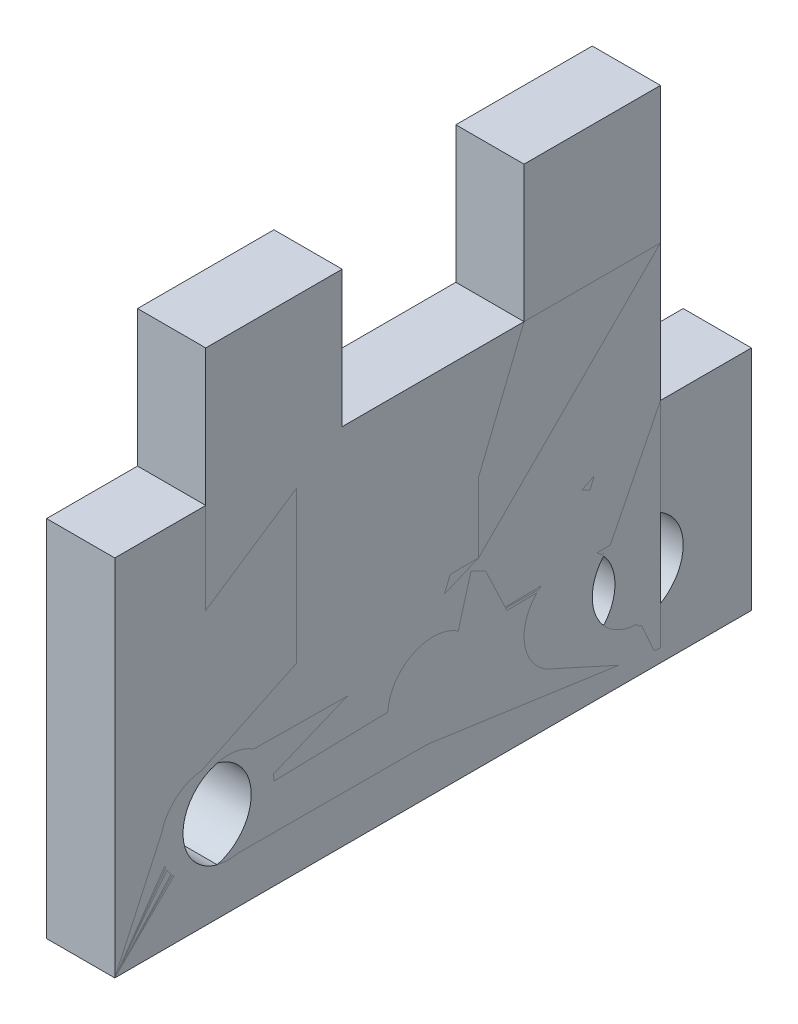
ISO-10303-21;
HEADER;
FILE_DESCRIPTION(('STEP AP214'),'2;1');
FILE_NAME('part.step','',(''),(''),'','','');
FILE_SCHEMA(('AUTOMOTIVE_DESIGN { 1 0 10303 214 1 1 1 1 }'));
ENDSEC;
DATA;
#1=APPLICATION_CONTEXT('core data for automotive mechanical design processes');
#2=APPLICATION_PROTOCOL_DEFINITION('international standard','automotive_design',2000,#1);
#3=PRODUCT_CONTEXT('',#1,'mechanical');
#4=PRODUCT('Part','Part','',(#3));
#5=PRODUCT_RELATED_PRODUCT_CATEGORY('part','',(#4));
#6=PRODUCT_DEFINITION_FORMATION('','',#4);
#7=PRODUCT_DEFINITION_CONTEXT('part definition',#1,'design');
#8=PRODUCT_DEFINITION('design','',#6,#7);
#9=PRODUCT_DEFINITION_SHAPE('','',#8);
#10=(LENGTH_UNIT() NAMED_UNIT(*) SI_UNIT(.MILLI.,.METRE.));
#11=(NAMED_UNIT(*) PLANE_ANGLE_UNIT() SI_UNIT($,.RADIAN.));
#12=(NAMED_UNIT(*) SI_UNIT($,.STERADIAN.) SOLID_ANGLE_UNIT());
#13=UNCERTAINTY_MEASURE_WITH_UNIT(LENGTH_MEASURE(1.E-05),#10,'distance_accuracy_value','');
#14=(GEOMETRIC_REPRESENTATION_CONTEXT(3) GLOBAL_UNCERTAINTY_ASSIGNED_CONTEXT((#13)) GLOBAL_UNIT_ASSIGNED_CONTEXT((#10,
#11,#12)) REPRESENTATION_CONTEXT('',''));
#15=CARTESIAN_POINT('',(0.,0.,0.));
#16=DIRECTION('',(0.,0.,1.));
#17=DIRECTION('',(1.,0.,0.));
#18=AXIS2_PLACEMENT_3D('',#15,#16,#17);
#19=CARTESIAN_POINT('',(15.,0.,0.));
#20=DIRECTION('',(-1.,0.,0.));
#21=DIRECTION('',(0.,0.,1.));
#22=AXIS2_PLACEMENT_3D('',#19,#20,#21);
#23=PLANE('',#22);
#24=DIRECTION('',(0.,-1.,0.));
#25=VECTOR('',#24,1.);
#26=CARTESIAN_POINT('',(15.,0.,0.));
#27=LINE('',#26,#25);
#28=CARTESIAN_POINT('',(15.,60.,0.));
#29=VERTEX_POINT('',#28);
#30=CARTESIAN_POINT('',(15.,0.,0.));
#31=VERTEX_POINT('',#30);
#32=EDGE_CURVE('E212',#29,#31,#27,.T.);
#33=ORIENTED_EDGE('',*,*,#32,.T.);
#34=DIRECTION('',(0.,0.,-1.));
#35=VECTOR('',#34,1.);
#36=CARTESIAN_POINT('',(15.,0.,0.));
#37=LINE('',#36,#35);
#38=CARTESIAN_POINT('',(15.,0.,-140.));
#39=VERTEX_POINT('',#38);
#40=EDGE_CURVE('E124',#31,#39,#37,.T.);
#41=ORIENTED_EDGE('',*,*,#40,.T.);
#42=DIRECTION('',(0.,1.,0.));
#43=VECTOR('',#42,1.);
#44=CARTESIAN_POINT('',(15.,50.,-140.));
#45=LINE('',#44,#43);
#46=CARTESIAN_POINT('',(15.,50.,-140.));
#47=VERTEX_POINT('',#46);
#48=EDGE_CURVE('E249',#39,#47,#45,.T.);
#49=ORIENTED_EDGE('',*,*,#48,.T.);
#50=DIRECTION('',(0.,0.,1.));
#51=VECTOR('',#50,1.);
#52=CARTESIAN_POINT('',(15.,50.,-120.));
#53=LINE('',#52,#51);
#54=CARTESIAN_POINT('',(15.,50.,-120.));
#55=VERTEX_POINT('',#54);
#56=EDGE_CURVE('E269',#47,#55,#53,.T.);
#57=ORIENTED_EDGE('',*,*,#56,.T.);
#58=DIRECTION('',(0.,1.,0.));
#59=VECTOR('',#58,1.);
#60=CARTESIAN_POINT('',(15.,110.,-120.));
#61=LINE('',#60,#59);
#62=CARTESIAN_POINT('',(15.,110.,-120.));
#63=VERTEX_POINT('',#62);
#64=EDGE_CURVE('E265',#55,#63,#61,.T.);
#65=ORIENTED_EDGE('',*,*,#64,.T.);
#66=DIRECTION('',(0.,0.,1.));
#67=VECTOR('',#66,1.);
#68=CARTESIAN_POINT('',(15.,110.,-90.));
#69=LINE('',#68,#67);
#70=CARTESIAN_POINT('',(15.,110.,-90.));
#71=VERTEX_POINT('',#70);
#72=EDGE_CURVE('E268',#63,#71,#69,.T.);
#73=ORIENTED_EDGE('',*,*,#72,.T.);
#74=DIRECTION('',(0.,-1.,0.));
#75=VECTOR('',#74,1.);
#76=CARTESIAN_POINT('',(15.,80.,-90.));
#77=LINE('',#76,#75);
#78=CARTESIAN_POINT('',(15.,80.,-90.));
#79=VERTEX_POINT('',#78);
#80=EDGE_CURVE('E273',#71,#79,#77,.T.);
#81=ORIENTED_EDGE('',*,*,#80,.T.);
#82=DIRECTION('',(0.,0.,1.));
#83=VECTOR('',#82,1.);
#84=CARTESIAN_POINT('',(15.,80.,-50.));
#85=LINE('',#84,#83);
#86=CARTESIAN_POINT('',(15.,80.,-50.));
#87=VERTEX_POINT('',#86);
#88=EDGE_CURVE('E280',#79,#87,#85,.T.);
#89=ORIENTED_EDGE('',*,*,#88,.T.);
#90=DIRECTION('',(0.,1.,0.));
#91=VECTOR('',#90,1.);
#92=CARTESIAN_POINT('',(15.,110.,-50.));
#93=LINE('',#92,#91);
#94=CARTESIAN_POINT('',(15.,110.,-50.));
#95=VERTEX_POINT('',#94);
#96=EDGE_CURVE('E155',#87,#95,#93,.T.);
#97=ORIENTED_EDGE('',*,*,#96,.T.);
#98=DIRECTION('',(0.,0.,1.));
#99=VECTOR('',#98,1.);
#100=CARTESIAN_POINT('',(15.,110.,-20.));
#101=LINE('',#100,#99);
#102=CARTESIAN_POINT('',(15.,110.,-20.));
#103=VERTEX_POINT('',#102);
#104=EDGE_CURVE('E149',#95,#103,#101,.T.);
#105=ORIENTED_EDGE('',*,*,#104,.T.);
#106=DIRECTION('',(0.,-1.,0.));
#107=VECTOR('',#106,1.);
#108=CARTESIAN_POINT('',(15.,60.,-20.));
#109=LINE('',#108,#107);
#110=CARTESIAN_POINT('',(15.,60.,-20.));
#111=VERTEX_POINT('',#110);
#112=EDGE_CURVE('E153',#103,#111,#109,.T.);
#113=ORIENTED_EDGE('',*,*,#112,.T.);
#114=DIRECTION('',(0.,0.,1.));
#115=VECTOR('',#114,1.);
#116=CARTESIAN_POINT('',(15.,60.,0.));
#117=LINE('',#116,#115);
#118=EDGE_CURVE('E69',#111,#29,#117,.T.);
#119=ORIENTED_EDGE('',*,*,#118,.T.);
#120=EDGE_LOOP('',(#33,#41,#49,#57,#65,#73,#81,#89,#97,#105,#113,#119));
#121=FACE_BOUND('',#120,.T.);
#122=CARTESIAN_POINT('',(15.,20.,-70.));
#123=DIRECTION('',(1.,0.,0.));
#124=DIRECTION('',(0.,0.,-1.));
#125=AXIS2_PLACEMENT_3D('',#122,#123,#124);
#126=CIRCLE('',#125,9.99999999999999);
#127=CARTESIAN_POINT('',(15.,20.,-80.));
#128=VERTEX_POINT('',#127);
#129=EDGE_CURVE('E182',#128,#128,#126,.T.);
#130=ORIENTED_EDGE('',*,*,#129,.F.);
#131=EDGE_LOOP('',(#130));
#132=FACE_BOUND('',#131,.T.);
#133=CARTESIAN_POINT('',(15.,20.,-115.));
#134=DIRECTION('',(1.,0.,0.));
#135=DIRECTION('',(0.,0.,-1.));
#136=AXIS2_PLACEMENT_3D('',#133,#134,#135);
#137=CIRCLE('',#136,9.99999999999999);
#138=CARTESIAN_POINT('',(15.,20.,-125.));
#139=VERTEX_POINT('',#138);
#140=EDGE_CURVE('E338',#139,#139,#137,.T.);
#141=ORIENTED_EDGE('',*,*,#140,.F.);
#142=EDGE_LOOP('',(#141));
#143=FACE_BOUND('',#142,.T.);
#144=CARTESIAN_POINT('',(15.,20.,-25.));
#145=DIRECTION('',(1.,0.,0.));
#146=DIRECTION('',(0.,0.,-1.));
#147=AXIS2_PLACEMENT_3D('',#144,#145,#146);
#148=CIRCLE('',#147,10.);
#149=CARTESIAN_POINT('',(15.,20.,-35.));
#150=VERTEX_POINT('',#149);
#151=EDGE_CURVE('E327',#150,#150,#148,.T.);
#152=ORIENTED_EDGE('',*,*,#151,.F.);
#153=EDGE_LOOP('',(#152));
#154=FACE_BOUND('',#153,.T.);
#155=ADVANCED_FACE('F51',(#121,#132,#143,#154),#23,.F.);
#156=CARTESIAN_POINT('',(0.,0.,0.));
#157=DIRECTION('',(-1.,0.,0.));
#158=DIRECTION('',(0.,0.,1.));
#159=AXIS2_PLACEMENT_3D('',#156,#157,#158);
#160=PLANE('',#159);
#161=CARTESIAN_POINT('',(0.,20.,-115.));
#162=DIRECTION('',(1.,0.,0.));
#163=DIRECTION('',(0.,0.,-1.));
#164=AXIS2_PLACEMENT_3D('',#161,#162,#163);
#165=CIRCLE('',#164,9.99999999999999);
#166=CARTESIAN_POINT('',(0.,20.,-125.));
#167=VERTEX_POINT('',#166);
#168=EDGE_CURVE('E335',#167,#167,#165,.T.);
#169=ORIENTED_EDGE('',*,*,#168,.T.);
#170=EDGE_LOOP('',(#169));
#171=FACE_BOUND('',#170,.T.);
#172=DIRECTION('',(0.,-1.,0.));
#173=VECTOR('',#172,1.);
#174=CARTESIAN_POINT('',(0.,0.,0.));
#175=LINE('',#174,#173);
#176=CARTESIAN_POINT('',(0.,60.,0.));
#177=VERTEX_POINT('',#176);
#178=CARTESIAN_POINT('',(0.,0.,0.));
#179=VERTEX_POINT('',#178);
#180=EDGE_CURVE('E177',#177,#179,#175,.T.);
#181=ORIENTED_EDGE('',*,*,#180,.F.);
#182=DIRECTION('',(0.,0.,1.));
#183=VECTOR('',#182,1.);
#184=CARTESIAN_POINT('',(0.,60.,0.));
#185=LINE('',#184,#183);
#186=CARTESIAN_POINT('',(0.,60.,-20.));
#187=VERTEX_POINT('',#186);
#188=EDGE_CURVE('E116',#187,#177,#185,.T.);
#189=ORIENTED_EDGE('',*,*,#188,.F.);
#190=DIRECTION('',(0.,-1.,0.));
#191=VECTOR('',#190,1.);
#192=CARTESIAN_POINT('',(0.,60.,-20.));
#193=LINE('',#192,#191);
#194=CARTESIAN_POINT('',(0.,110.,-20.));
#195=VERTEX_POINT('',#194);
#196=EDGE_CURVE('E110',#195,#187,#193,.T.);
#197=ORIENTED_EDGE('',*,*,#196,.F.);
#198=DIRECTION('',(0.,0.,1.));
#199=VECTOR('',#198,1.);
#200=CARTESIAN_POINT('',(0.,110.,-20.));
#201=LINE('',#200,#199);
#202=CARTESIAN_POINT('',(0.,110.,-50.));
#203=VERTEX_POINT('',#202);
#204=EDGE_CURVE('E164',#203,#195,#201,.T.);
#205=ORIENTED_EDGE('',*,*,#204,.F.);
#206=DIRECTION('',(0.,1.,0.));
#207=VECTOR('',#206,1.);
#208=CARTESIAN_POINT('',(0.,110.,-50.));
#209=LINE('',#208,#207);
#210=CARTESIAN_POINT('',(0.,80.,-50.));
#211=VERTEX_POINT('',#210);
#212=EDGE_CURVE('E203',#211,#203,#209,.T.);
#213=ORIENTED_EDGE('',*,*,#212,.F.);
#214=DIRECTION('',(0.,0.,1.));
#215=VECTOR('',#214,1.);
#216=CARTESIAN_POINT('',(0.,80.,-50.));
#217=LINE('',#216,#215);
#218=CARTESIAN_POINT('',(0.,80.,-90.));
#219=VERTEX_POINT('',#218);
#220=EDGE_CURVE('E200',#219,#211,#217,.T.);
#221=ORIENTED_EDGE('',*,*,#220,.F.);
#222=DIRECTION('',(0.,-1.,0.));
#223=VECTOR('',#222,1.);
#224=CARTESIAN_POINT('',(0.,80.,-90.));
#225=LINE('',#224,#223);
#226=CARTESIAN_POINT('',(0.,110.,-90.));
#227=VERTEX_POINT('',#226);
#228=EDGE_CURVE('E197',#227,#219,#225,.T.);
#229=ORIENTED_EDGE('',*,*,#228,.F.);
#230=DIRECTION('',(0.,0.,1.));
#231=VECTOR('',#230,1.);
#232=CARTESIAN_POINT('',(0.,110.,-90.));
#233=LINE('',#232,#231);
#234=CARTESIAN_POINT('',(0.,110.,-120.));
#235=VERTEX_POINT('',#234);
#236=EDGE_CURVE('E194',#235,#227,#233,.T.);
#237=ORIENTED_EDGE('',*,*,#236,.F.);
#238=DIRECTION('',(0.,1.,0.));
#239=VECTOR('',#238,1.);
#240=CARTESIAN_POINT('',(0.,110.,-120.));
#241=LINE('',#240,#239);
#242=CARTESIAN_POINT('',(0.,50.,-120.));
#243=VERTEX_POINT('',#242);
#244=EDGE_CURVE('E191',#243,#235,#241,.T.);
#245=ORIENTED_EDGE('',*,*,#244,.F.);
#246=DIRECTION('',(0.,0.,1.));
#247=VECTOR('',#246,1.);
#248=CARTESIAN_POINT('',(0.,50.,-120.));
#249=LINE('',#248,#247);
#250=CARTESIAN_POINT('',(0.,50.,-140.));
#251=VERTEX_POINT('',#250);
#252=EDGE_CURVE('E188',#251,#243,#249,.T.);
#253=ORIENTED_EDGE('',*,*,#252,.F.);
#254=DIRECTION('',(0.,1.,0.));
#255=VECTOR('',#254,1.);
#256=CARTESIAN_POINT('',(0.,50.,-140.));
#257=LINE('',#256,#255);
#258=CARTESIAN_POINT('',(0.,0.,-140.));
#259=VERTEX_POINT('',#258);
#260=EDGE_CURVE('E185',#259,#251,#257,.T.);
#261=ORIENTED_EDGE('',*,*,#260,.F.);
#262=DIRECTION('',(0.,0.,-1.));
#263=VECTOR('',#262,1.);
#264=CARTESIAN_POINT('',(0.,0.,0.));
#265=LINE('',#264,#263);
#266=EDGE_CURVE('E181',#179,#259,#265,.T.);
#267=ORIENTED_EDGE('',*,*,#266,.F.);
#268=EDGE_LOOP('',(#181,#189,#197,#205,#213,#221,#229,#237,#245,#253,#261,#267));
#269=FACE_BOUND('',#268,.T.);
#270=CARTESIAN_POINT('',(0.,20.,-70.));
#271=DIRECTION('',(1.,0.,0.));
#272=DIRECTION('',(0.,0.,-1.));
#273=AXIS2_PLACEMENT_3D('',#270,#271,#272);
#274=CIRCLE('',#273,9.99999999999999);
#275=CARTESIAN_POINT('',(0.,20.,-80.));
#276=VERTEX_POINT('',#275);
#277=EDGE_CURVE('E342',#276,#276,#274,.T.);
#278=ORIENTED_EDGE('',*,*,#277,.T.);
#279=EDGE_LOOP('',(#278));
#280=FACE_BOUND('',#279,.T.);
#281=CARTESIAN_POINT('',(0.,20.,-25.));
#282=DIRECTION('',(1.,0.,0.));
#283=DIRECTION('',(0.,0.,-1.));
#284=AXIS2_PLACEMENT_3D('',#281,#282,#283);
#285=CIRCLE('',#284,10.);
#286=CARTESIAN_POINT('',(0.,20.,-35.));
#287=VERTEX_POINT('',#286);
#288=EDGE_CURVE('E330',#287,#287,#285,.T.);
#289=ORIENTED_EDGE('',*,*,#288,.T.);
#290=EDGE_LOOP('',(#289));
#291=FACE_BOUND('',#290,.T.);
#292=ADVANCED_FACE('F253',(#171,#269,#280,#291),#160,.T.);
#293=CARTESIAN_POINT('',(15.,0.,0.));
#294=DIRECTION('',(0.,0.,-1.));
#295=DIRECTION('',(-1.,0.,0.));
#296=AXIS2_PLACEMENT_3D('',#293,#294,#295);
#297=PLANE('',#296);
#298=ORIENTED_EDGE('',*,*,#180,.T.);
#299=DIRECTION('',(-1.,0.,0.));
#300=VECTOR('',#299,1.);
#301=CARTESIAN_POINT('',(15.,0.,0.));
#302=LINE('',#301,#300);
#303=EDGE_CURVE('E12',#31,#179,#302,.T.);
#304=ORIENTED_EDGE('',*,*,#303,.F.);
#305=ORIENTED_EDGE('',*,*,#32,.F.);
#306=DIRECTION('',(-1.,0.,0.));
#307=VECTOR('',#306,1.);
#308=CARTESIAN_POINT('',(15.,60.,0.));
#309=LINE('',#308,#307);
#310=EDGE_CURVE('E173',#29,#177,#309,.T.);
#311=ORIENTED_EDGE('',*,*,#310,.T.);
#312=EDGE_LOOP('',(#298,#304,#305,#311));
#313=FACE_BOUND('',#312,.T.);
#314=ADVANCED_FACE('F53',(#313),#297,.F.);
#315=CARTESIAN_POINT('',(15.,0.,0.));
#316=DIRECTION('',(0.,1.,0.));
#317=DIRECTION('',(0.,0.,1.));
#318=AXIS2_PLACEMENT_3D('',#315,#316,#317);
#319=PLANE('',#318);
#320=ORIENTED_EDGE('',*,*,#266,.T.);
#321=DIRECTION('',(-1.,0.,0.));
#322=VECTOR('',#321,1.);
#323=CARTESIAN_POINT('',(15.,0.,-140.));
#324=LINE('',#323,#322);
#325=EDGE_CURVE('E61',#39,#259,#324,.T.);
#326=ORIENTED_EDGE('',*,*,#325,.F.);
#327=ORIENTED_EDGE('',*,*,#40,.F.);
#328=ORIENTED_EDGE('',*,*,#303,.T.);
#329=EDGE_LOOP('',(#320,#326,#327,#328));
#330=FACE_BOUND('',#329,.T.);
#331=ADVANCED_FACE('F451',(#330),#319,.F.);
#332=CARTESIAN_POINT('',(15.,50.,-140.));
#333=DIRECTION('',(0.,0.,1.));
#334=DIRECTION('',(1.,0.,0.));
#335=AXIS2_PLACEMENT_3D('',#332,#333,#334);
#336=PLANE('',#335);
#337=ORIENTED_EDGE('',*,*,#260,.T.);
#338=DIRECTION('',(-1.,0.,0.));
#339=VECTOR('',#338,1.);
#340=CARTESIAN_POINT('',(15.,50.,-140.));
#341=LINE('',#340,#339);
#342=EDGE_CURVE('E239',#47,#251,#341,.T.);
#343=ORIENTED_EDGE('',*,*,#342,.F.);
#344=ORIENTED_EDGE('',*,*,#48,.F.);
#345=ORIENTED_EDGE('',*,*,#325,.T.);
#346=EDGE_LOOP('',(#337,#343,#344,#345));
#347=FACE_BOUND('',#346,.T.);
#348=ADVANCED_FACE('F247',(#347),#336,.F.);
#349=CARTESIAN_POINT('',(15.,50.,-120.));
#350=DIRECTION('',(0.,-1.,0.));
#351=DIRECTION('',(0.,0.,-1.));
#352=AXIS2_PLACEMENT_3D('',#349,#350,#351);
#353=PLANE('',#352);
#354=ORIENTED_EDGE('',*,*,#252,.T.);
#355=DIRECTION('',(-1.,0.,0.));
#356=VECTOR('',#355,1.);
#357=CARTESIAN_POINT('',(15.,50.,-120.));
#358=LINE('',#357,#356);
#359=EDGE_CURVE('E235',#55,#243,#358,.T.);
#360=ORIENTED_EDGE('',*,*,#359,.F.);
#361=ORIENTED_EDGE('',*,*,#56,.F.);
#362=ORIENTED_EDGE('',*,*,#342,.T.);
#363=EDGE_LOOP('',(#354,#360,#361,#362));
#364=FACE_BOUND('',#363,.T.);
#365=ADVANCED_FACE('F259',(#364),#353,.F.);
#366=CARTESIAN_POINT('',(15.,110.,-120.));
#367=DIRECTION('',(0.,0.,1.));
#368=DIRECTION('',(0.,-1.,0.));
#369=AXIS2_PLACEMENT_3D('',#366,#367,#368);
#370=PLANE('',#369);
#371=ORIENTED_EDGE('',*,*,#244,.T.);
#372=DIRECTION('',(-1.,0.,0.));
#373=VECTOR('',#372,1.);
#374=CARTESIAN_POINT('',(15.,110.,-120.));
#375=LINE('',#374,#373);
#376=EDGE_CURVE('E231',#63,#235,#375,.T.);
#377=ORIENTED_EDGE('',*,*,#376,.F.);
#378=ORIENTED_EDGE('',*,*,#64,.F.);
#379=ORIENTED_EDGE('',*,*,#359,.T.);
#380=EDGE_LOOP('',(#371,#377,#378,#379));
#381=FACE_BOUND('',#380,.T.);
#382=ADVANCED_FACE('F263',(#381),#370,.F.);
#383=CARTESIAN_POINT('',(15.,110.,-90.));
#384=DIRECTION('',(0.,-1.,0.));
#385=DIRECTION('',(0.,0.,-1.));
#386=AXIS2_PLACEMENT_3D('',#383,#384,#385);
#387=PLANE('',#386);
#388=ORIENTED_EDGE('',*,*,#236,.T.);
#389=DIRECTION('',(-1.,0.,0.));
#390=VECTOR('',#389,1.);
#391=CARTESIAN_POINT('',(15.,110.,-90.));
#392=LINE('',#391,#390);
#393=EDGE_CURVE('E227',#71,#227,#392,.T.);
#394=ORIENTED_EDGE('',*,*,#393,.F.);
#395=ORIENTED_EDGE('',*,*,#72,.F.);
#396=ORIENTED_EDGE('',*,*,#376,.T.);
#397=EDGE_LOOP('',(#388,#394,#395,#396));
#398=FACE_BOUND('',#397,.T.);
#399=ADVANCED_FACE('F416',(#398),#387,.F.);
#400=CARTESIAN_POINT('',(15.,80.,-90.));
#401=DIRECTION('',(0.,0.,-1.));
#402=DIRECTION('',(-1.,0.,0.));
#403=AXIS2_PLACEMENT_3D('',#400,#401,#402);
#404=PLANE('',#403);
#405=ORIENTED_EDGE('',*,*,#228,.T.);
#406=DIRECTION('',(-1.,0.,0.));
#407=VECTOR('',#406,1.);
#408=CARTESIAN_POINT('',(15.,80.,-90.));
#409=LINE('',#408,#407);
#410=EDGE_CURVE('E223',#79,#219,#409,.T.);
#411=ORIENTED_EDGE('',*,*,#410,.F.);
#412=ORIENTED_EDGE('',*,*,#80,.F.);
#413=ORIENTED_EDGE('',*,*,#393,.T.);
#414=EDGE_LOOP('',(#405,#411,#412,#413));
#415=FACE_BOUND('',#414,.T.);
#416=ADVANCED_FACE('F407',(#415),#404,.F.);
#417=CARTESIAN_POINT('',(15.,80.,-50.));
#418=DIRECTION('',(0.,-1.,0.));
#419=DIRECTION('',(0.,0.,-1.));
#420=AXIS2_PLACEMENT_3D('',#417,#418,#419);
#421=PLANE('',#420);
#422=ORIENTED_EDGE('',*,*,#220,.T.);
#423=DIRECTION('',(-1.,0.,0.));
#424=VECTOR('',#423,1.);
#425=CARTESIAN_POINT('',(15.,80.,-50.));
#426=LINE('',#425,#424);
#427=EDGE_CURVE('E219',#87,#211,#426,.T.);
#428=ORIENTED_EDGE('',*,*,#427,.F.);
#429=ORIENTED_EDGE('',*,*,#88,.F.);
#430=ORIENTED_EDGE('',*,*,#410,.T.);
#431=EDGE_LOOP('',(#422,#428,#429,#430));
#432=FACE_BOUND('',#431,.T.);
#433=ADVANCED_FACE('F288',(#432),#421,.F.);
#434=CARTESIAN_POINT('',(15.,110.,-50.));
#435=DIRECTION('',(0.,0.,1.));
#436=DIRECTION('',(0.,-1.,0.));
#437=AXIS2_PLACEMENT_3D('',#434,#435,#436);
#438=PLANE('',#437);
#439=ORIENTED_EDGE('',*,*,#212,.T.);
#440=DIRECTION('',(-1.,0.,0.));
#441=VECTOR('',#440,1.);
#442=CARTESIAN_POINT('',(15.,110.,-50.));
#443=LINE('',#442,#441);
#444=EDGE_CURVE('E166',#95,#203,#443,.T.);
#445=ORIENTED_EDGE('',*,*,#444,.F.);
#446=ORIENTED_EDGE('',*,*,#96,.F.);
#447=ORIENTED_EDGE('',*,*,#427,.T.);
#448=EDGE_LOOP('',(#439,#445,#446,#447));
#449=FACE_BOUND('',#448,.T.);
#450=ADVANCED_FACE('F292',(#449),#438,.F.);
#451=CARTESIAN_POINT('',(15.,110.,-20.));
#452=DIRECTION('',(0.,-1.,0.));
#453=DIRECTION('',(0.,0.,-1.));
#454=AXIS2_PLACEMENT_3D('',#451,#452,#453);
#455=PLANE('',#454);
#456=ORIENTED_EDGE('',*,*,#204,.T.);
#457=DIRECTION('',(-1.,0.,0.));
#458=VECTOR('',#457,1.);
#459=CARTESIAN_POINT('',(15.,110.,-20.));
#460=LINE('',#459,#458);
#461=EDGE_CURVE('E161',#103,#195,#460,.T.);
#462=ORIENTED_EDGE('',*,*,#461,.F.);
#463=ORIENTED_EDGE('',*,*,#104,.F.);
#464=ORIENTED_EDGE('',*,*,#444,.T.);
#465=EDGE_LOOP('',(#456,#462,#463,#464));
#466=FACE_BOUND('',#465,.T.);
#467=ADVANCED_FACE('F162',(#466),#455,.F.);
#468=CARTESIAN_POINT('',(15.,60.,-20.));
#469=DIRECTION('',(0.,0.,-1.));
#470=DIRECTION('',(-1.,0.,0.));
#471=AXIS2_PLACEMENT_3D('',#468,#469,#470);
#472=PLANE('',#471);
#473=ORIENTED_EDGE('',*,*,#196,.T.);
#474=DIRECTION('',(-1.,0.,0.));
#475=VECTOR('',#474,1.);
#476=CARTESIAN_POINT('',(15.,60.,-20.));
#477=LINE('',#476,#475);
#478=EDGE_CURVE('E167',#111,#187,#477,.T.);
#479=ORIENTED_EDGE('',*,*,#478,.F.);
#480=ORIENTED_EDGE('',*,*,#112,.F.);
#481=ORIENTED_EDGE('',*,*,#461,.T.);
#482=EDGE_LOOP('',(#473,#479,#480,#481));
#483=FACE_BOUND('',#482,.T.);
#484=ADVANCED_FACE('F169',(#483),#472,.F.);
#485=CARTESIAN_POINT('',(15.,60.,0.));
#486=DIRECTION('',(0.,-1.,0.));
#487=DIRECTION('',(0.,0.,-1.));
#488=AXIS2_PLACEMENT_3D('',#485,#486,#487);
#489=PLANE('',#488);
#490=ORIENTED_EDGE('',*,*,#188,.T.);
#491=ORIENTED_EDGE('',*,*,#310,.F.);
#492=ORIENTED_EDGE('',*,*,#118,.F.);
#493=ORIENTED_EDGE('',*,*,#478,.T.);
#494=EDGE_LOOP('',(#490,#491,#492,#493));
#495=FACE_BOUND('',#494,.T.);
#496=ADVANCED_FACE('F296',(#495),#489,.F.);
#497=CARTESIAN_POINT('',(15.,20.,-70.));
#498=DIRECTION('',(-1.,0.,0.));
#499=DIRECTION('',(0.,0.,1.));
#500=AXIS2_PLACEMENT_3D('',#497,#498,#499);
#501=CYLINDRICAL_SURFACE('',#500,9.99999999999999);
#502=ORIENTED_EDGE('',*,*,#129,.T.);
#503=EDGE_LOOP('',(#502));
#504=FACE_BOUND('',#503,.T.);
#505=ORIENTED_EDGE('',*,*,#277,.F.);
#506=EDGE_LOOP('',(#505));
#507=FACE_BOUND('',#506,.T.);
#508=ADVANCED_FACE('F298',(#504,#507),#501,.F.);
#509=CARTESIAN_POINT('',(15.,20.,-115.));
#510=DIRECTION('',(-1.,0.,0.));
#511=DIRECTION('',(0.,0.,1.));
#512=AXIS2_PLACEMENT_3D('',#509,#510,#511);
#513=CYLINDRICAL_SURFACE('',#512,9.99999999999999);
#514=ORIENTED_EDGE('',*,*,#140,.T.);
#515=EDGE_LOOP('',(#514));
#516=FACE_BOUND('',#515,.T.);
#517=ORIENTED_EDGE('',*,*,#168,.F.);
#518=EDGE_LOOP('',(#517));
#519=FACE_BOUND('',#518,.T.);
#520=ADVANCED_FACE('F304',(#516,#519),#513,.F.);
#521=CARTESIAN_POINT('',(15.,20.,-25.));
#522=DIRECTION('',(-1.,0.,0.));
#523=DIRECTION('',(0.,0.,1.));
#524=AXIS2_PLACEMENT_3D('',#521,#522,#523);
#525=CYLINDRICAL_SURFACE('',#524,10.);
#526=ORIENTED_EDGE('',*,*,#151,.T.);
#527=EDGE_LOOP('',(#526));
#528=FACE_BOUND('',#527,.T.);
#529=ORIENTED_EDGE('',*,*,#288,.F.);
#530=EDGE_LOOP('',(#529));
#531=FACE_BOUND('',#530,.T.);
#532=ADVANCED_FACE('F318',(#528,#531),#525,.F.);
#533=CLOSED_SHELL('',(#155,#292,#314,#331,#348,#365,#382,#399,#416,#433,#450,#467,#484,#496,
#508,#520,#532));
#534=MANIFOLD_SOLID_BREP('B2',#533);
#535=CARTESIAN_POINT('',(15.,80.,0.));
#536=DIRECTION('',(0.,0.,-1.));
#537=DIRECTION('',(0.,1.,0.));
#538=AXIS2_PLACEMENT_3D('',#535,#536,#537);
#539=PLANE('',#538);
#540=DIRECTION('',(0.,-1.,0.));
#541=VECTOR('',#540,1.);
#542=CARTESIAN_POINT('',(0.,80.,0.));
#543=LINE('',#542,#541);
#544=CARTESIAN_POINT('',(0.,80.,0.));
#545=VERTEX_POINT('',#544);
#546=CARTESIAN_POINT('',(0.,0.,0.));
#547=VERTEX_POINT('',#546);
#548=EDGE_CURVE('E583',#545,#547,#543,.T.);
#549=ORIENTED_EDGE('',*,*,#548,.T.);
#550=DIRECTION('',(-1.,0.,0.));
#551=VECTOR('',#550,1.);
#552=CARTESIAN_POINT('',(15.,0.,0.));
#553=LINE('',#552,#551);
#554=CARTESIAN_POINT('',(15.,0.,0.));
#555=VERTEX_POINT('',#554);
#556=EDGE_CURVE('E49',#555,#547,#553,.T.);
#557=ORIENTED_EDGE('',*,*,#556,.F.);
#558=DIRECTION('',(0.,-1.,0.));
#559=VECTOR('',#558,1.);
#560=CARTESIAN_POINT('',(15.,80.,0.));
#561=LINE('',#560,#559);
#562=CARTESIAN_POINT('',(15.,80.,0.));
#563=VERTEX_POINT('',#562);
#564=EDGE_CURVE('E598',#563,#555,#561,.T.);
#565=ORIENTED_EDGE('',*,*,#564,.F.);
#566=DIRECTION('',(-1.,0.,0.));
#567=VECTOR('',#566,1.);
#568=CARTESIAN_POINT('',(15.,80.,0.));
#569=LINE('',#568,#567);
#570=EDGE_CURVE('E579',#563,#545,#569,.T.);
#571=ORIENTED_EDGE('',*,*,#570,.T.);
#572=EDGE_LOOP('',(#549,#557,#565,#571));
#573=FACE_BOUND('',#572,.T.);
#574=ADVANCED_FACE('F487',(#573),#539,.F.);
#575=CARTESIAN_POINT('',(15.,0.,0.));
#576=DIRECTION('',(0.,1.,0.));
#577=DIRECTION('',(0.,0.,1.));
#578=AXIS2_PLACEMENT_3D('',#575,#576,#577);
#579=PLANE('',#578);
#580=DIRECTION('',(0.,0.,-1.));
#581=VECTOR('',#580,1.);
#582=CARTESIAN_POINT('',(0.,0.,0.));
#583=LINE('',#582,#581);
#584=CARTESIAN_POINT('',(0.,0.,-120.));
#585=VERTEX_POINT('',#584);
#586=EDGE_CURVE('E586',#547,#585,#583,.T.);
#587=ORIENTED_EDGE('',*,*,#586,.T.);
#588=DIRECTION('',(-1.,0.,0.));
#589=VECTOR('',#588,1.);
#590=CARTESIAN_POINT('',(15.,0.,-120.));
#591=LINE('',#590,#589);
#592=CARTESIAN_POINT('',(15.,0.,-120.));
#593=VERTEX_POINT('',#592);
#594=EDGE_CURVE('E495',#593,#585,#591,.T.);
#595=ORIENTED_EDGE('',*,*,#594,.F.);
#596=DIRECTION('',(0.,0.,-1.));
#597=VECTOR('',#596,1.);
#598=CARTESIAN_POINT('',(15.,0.,0.));
#599=LINE('',#598,#597);
#600=EDGE_CURVE('E546',#555,#593,#599,.T.);
#601=ORIENTED_EDGE('',*,*,#600,.F.);
#602=ORIENTED_EDGE('',*,*,#556,.T.);
#603=EDGE_LOOP('',(#587,#595,#601,#602));
#604=FACE_BOUND('',#603,.T.);
#605=ADVANCED_FACE('F665',(#604),#579,.F.);
#606=CARTESIAN_POINT('',(15.,0.,-120.));
#607=DIRECTION('',(0.,0.,1.));
#608=DIRECTION('',(1.,0.,0.));
#609=AXIS2_PLACEMENT_3D('',#606,#607,#608);
#610=PLANE('',#609);
#611=DIRECTION('',(0.,1.,0.));
#612=VECTOR('',#611,1.);
#613=CARTESIAN_POINT('',(0.,0.,-120.));
#614=LINE('',#613,#612);
#615=CARTESIAN_POINT('',(0.,80.,-120.));
#616=VERTEX_POINT('',#615);
#617=EDGE_CURVE('E589',#585,#616,#614,.T.);
#618=ORIENTED_EDGE('',*,*,#617,.T.);
#619=DIRECTION('',(-1.,0.,0.));
#620=VECTOR('',#619,1.);
#621=CARTESIAN_POINT('',(15.,80.,-120.));
#622=LINE('',#621,#620);
#623=CARTESIAN_POINT('',(15.,80.,-120.));
#624=VERTEX_POINT('',#623);
#625=EDGE_CURVE('E605',#624,#616,#622,.T.);
#626=ORIENTED_EDGE('',*,*,#625,.F.);
#627=DIRECTION('',(0.,1.,0.));
#628=VECTOR('',#627,1.);
#629=CARTESIAN_POINT('',(15.,0.,-120.));
#630=LINE('',#629,#628);
#631=EDGE_CURVE('E613',#593,#624,#630,.T.);
#632=ORIENTED_EDGE('',*,*,#631,.F.);
#633=ORIENTED_EDGE('',*,*,#594,.T.);
#634=EDGE_LOOP('',(#618,#626,#632,#633));
#635=FACE_BOUND('',#634,.T.);
#636=ADVANCED_FACE('F611',(#635),#610,.F.);
#637=CARTESIAN_POINT('',(15.,80.,-120.));
#638=DIRECTION('',(0.,-1.,0.));
#639=DIRECTION('',(0.,0.,-1.));
#640=AXIS2_PLACEMENT_3D('',#637,#638,#639);
#641=PLANE('',#640);
#642=DIRECTION('',(0.,0.,1.));
#643=VECTOR('',#642,1.);
#644=CARTESIAN_POINT('',(0.,80.,-120.));
#645=LINE('',#644,#643);
#646=CARTESIAN_POINT('',(0.,80.,-80.));
#647=VERTEX_POINT('',#646);
#648=EDGE_CURVE('E591',#616,#647,#645,.T.);
#649=ORIENTED_EDGE('',*,*,#648,.T.);
#650=DIRECTION('',(-1.,0.,0.));
#651=VECTOR('',#650,1.);
#652=CARTESIAN_POINT('',(15.,80.,-80.));
#653=LINE('',#652,#651);
#654=CARTESIAN_POINT('',(15.,80.,-80.));
#655=VERTEX_POINT('',#654);
#656=EDGE_CURVE('E602',#655,#647,#653,.T.);
#657=ORIENTED_EDGE('',*,*,#656,.F.);
#658=DIRECTION('',(0.,0.,1.));
#659=VECTOR('',#658,1.);
#660=CARTESIAN_POINT('',(15.,80.,-120.));
#661=LINE('',#660,#659);
#662=EDGE_CURVE('E625',#624,#655,#661,.T.);
#663=ORIENTED_EDGE('',*,*,#662,.F.);
#664=ORIENTED_EDGE('',*,*,#625,.T.);
#665=EDGE_LOOP('',(#649,#657,#663,#664));
#666=FACE_BOUND('',#665,.T.);
#667=ADVANCED_FACE('F621',(#666),#641,.F.);
#668=CARTESIAN_POINT('',(15.,80.,-80.));
#669=DIRECTION('',(0.,0.,-1.));
#670=DIRECTION('',(-1.,0.,0.));
#671=AXIS2_PLACEMENT_3D('',#668,#669,#670);
#672=PLANE('',#671);
#673=DIRECTION('',(0.,-1.,0.));
#674=VECTOR('',#673,1.);
#675=CARTESIAN_POINT('',(0.,80.,-80.));
#676=LINE('',#675,#674);
#677=CARTESIAN_POINT('',(0.,40.,-80.));
#678=VERTEX_POINT('',#677);
#679=EDGE_CURVE('E593',#647,#678,#676,.T.);
#680=ORIENTED_EDGE('',*,*,#679,.T.);
#681=DIRECTION('',(-1.,0.,0.));
#682=VECTOR('',#681,1.);
#683=CARTESIAN_POINT('',(15.,40.,-80.));
#684=LINE('',#683,#682);
#685=CARTESIAN_POINT('',(15.,40.,-80.));
#686=VERTEX_POINT('',#685);
#687=EDGE_CURVE('E574',#686,#678,#684,.T.);
#688=ORIENTED_EDGE('',*,*,#687,.F.);
#689=DIRECTION('',(0.,-1.,0.));
#690=VECTOR('',#689,1.);
#691=CARTESIAN_POINT('',(15.,80.,-80.));
#692=LINE('',#691,#690);
#693=EDGE_CURVE('E565',#655,#686,#692,.T.);
#694=ORIENTED_EDGE('',*,*,#693,.F.);
#695=ORIENTED_EDGE('',*,*,#656,.T.);
#696=EDGE_LOOP('',(#680,#688,#694,#695));
#697=FACE_BOUND('',#696,.T.);
#698=ADVANCED_FACE('F624',(#697),#672,.F.);
#699=CARTESIAN_POINT('',(15.,40.,-80.));
#700=DIRECTION('',(0.,-1.,0.));
#701=DIRECTION('',(0.,0.,-1.));
#702=AXIS2_PLACEMENT_3D('',#699,#700,#701);
#703=PLANE('',#702);
#704=DIRECTION('',(0.,0.,1.));
#705=VECTOR('',#704,1.);
#706=CARTESIAN_POINT('',(0.,40.,-80.));
#707=LINE('',#706,#705);
#708=CARTESIAN_POINT('',(0.,40.,-40.));
#709=VERTEX_POINT('',#708);
#710=EDGE_CURVE('E573',#678,#709,#707,.T.);
#711=ORIENTED_EDGE('',*,*,#710,.T.);
#712=DIRECTION('',(-1.,0.,0.));
#713=VECTOR('',#712,1.);
#714=CARTESIAN_POINT('',(15.,40.,-40.));
#715=LINE('',#714,#713);
#716=CARTESIAN_POINT('',(15.,40.,-40.));
#717=VERTEX_POINT('',#716);
#718=EDGE_CURVE('E570',#717,#709,#715,.T.);
#719=ORIENTED_EDGE('',*,*,#718,.F.);
#720=DIRECTION('',(0.,0.,1.));
#721=VECTOR('',#720,1.);
#722=CARTESIAN_POINT('',(15.,40.,-80.));
#723=LINE('',#722,#721);
#724=EDGE_CURVE('E559',#686,#717,#723,.T.);
#725=ORIENTED_EDGE('',*,*,#724,.F.);
#726=ORIENTED_EDGE('',*,*,#687,.T.);
#727=EDGE_LOOP('',(#711,#719,#725,#726));
#728=FACE_BOUND('',#727,.T.);
#729=ADVANCED_FACE('F571',(#728),#703,.F.);
#730=CARTESIAN_POINT('',(15.,40.,-40.));
#731=DIRECTION('',(0.,0.,1.));
#732=DIRECTION('',(0.,-1.,0.));
#733=AXIS2_PLACEMENT_3D('',#730,#731,#732);
#734=PLANE('',#733);
#735=DIRECTION('',(0.,1.,0.));
#736=VECTOR('',#735,1.);
#737=CARTESIAN_POINT('',(0.,40.,-40.));
#738=LINE('',#737,#736);
#739=CARTESIAN_POINT('',(0.,80.,-40.));
#740=VERTEX_POINT('',#739);
#741=EDGE_CURVE('E532',#709,#740,#738,.T.);
#742=ORIENTED_EDGE('',*,*,#741,.T.);
#743=DIRECTION('',(-1.,0.,0.));
#744=VECTOR('',#743,1.);
#745=CARTESIAN_POINT('',(15.,80.,-40.));
#746=LINE('',#745,#744);
#747=CARTESIAN_POINT('',(15.,80.,-40.));
#748=VERTEX_POINT('',#747);
#749=EDGE_CURVE('E575',#748,#740,#746,.T.);
#750=ORIENTED_EDGE('',*,*,#749,.F.);
#751=DIRECTION('',(0.,1.,0.));
#752=VECTOR('',#751,1.);
#753=CARTESIAN_POINT('',(15.,40.,-40.));
#754=LINE('',#753,#752);
#755=EDGE_CURVE('E563',#717,#748,#754,.T.);
#756=ORIENTED_EDGE('',*,*,#755,.F.);
#757=ORIENTED_EDGE('',*,*,#718,.T.);
#758=EDGE_LOOP('',(#742,#750,#756,#757));
#759=FACE_BOUND('',#758,.T.);
#760=ADVANCED_FACE('F577',(#759),#734,.F.);
#761=CARTESIAN_POINT('',(15.,80.,-40.));
#762=DIRECTION('',(0.,-1.,0.));
#763=DIRECTION('',(0.,0.,-1.));
#764=AXIS2_PLACEMENT_3D('',#761,#762,#763);
#765=PLANE('',#764);
#766=DIRECTION('',(0.,0.,1.));
#767=VECTOR('',#766,1.);
#768=CARTESIAN_POINT('',(0.,80.,-40.));
#769=LINE('',#768,#767);
#770=EDGE_CURVE('E538',#740,#545,#769,.T.);
#771=ORIENTED_EDGE('',*,*,#770,.T.);
#772=ORIENTED_EDGE('',*,*,#570,.F.);
#773=DIRECTION('',(0.,0.,1.));
#774=VECTOR('',#773,1.);
#775=CARTESIAN_POINT('',(15.,80.,-40.));
#776=LINE('',#775,#774);
#777=EDGE_CURVE('E503',#748,#563,#776,.T.);
#778=ORIENTED_EDGE('',*,*,#777,.F.);
#779=ORIENTED_EDGE('',*,*,#749,.T.);
#780=EDGE_LOOP('',(#771,#772,#778,#779));
#781=FACE_BOUND('',#780,.T.);
#782=ADVANCED_FACE('F672',(#781),#765,.F.);
#783=CARTESIAN_POINT('',(15.,0.,0.));
#784=DIRECTION('',(1.,0.,0.));
#785=DIRECTION('',(0.,0.,-1.));
#786=AXIS2_PLACEMENT_3D('',#783,#784,#785);
#787=PLANE('',#786);
#788=CARTESIAN_POINT('',(15.,20.,-100.));
#789=DIRECTION('',(-1.,0.,0.));
#790=DIRECTION('',(0.,0.,1.));
#791=AXIS2_PLACEMENT_3D('',#788,#789,#790);
#792=CIRCLE('',#791,9.99999999999999);
#793=CARTESIAN_POINT('',(15.,20.,-90.));
#794=VERTEX_POINT('',#793);
#795=EDGE_CURVE('E587',#794,#794,#792,.T.);
#796=ORIENTED_EDGE('',*,*,#795,.T.);
#797=EDGE_LOOP('',(#796));
#798=FACE_BOUND('',#797,.T.);
#799=CARTESIAN_POINT('',(15.,20.,-20.));
#800=DIRECTION('',(-1.,0.,0.));
#801=DIRECTION('',(0.,0.,1.));
#802=AXIS2_PLACEMENT_3D('',#799,#800,#801);
#803=CIRCLE('',#802,10.);
#804=CARTESIAN_POINT('',(15.,20.,-9.99999999999999));
#805=VERTEX_POINT('',#804);
#806=EDGE_CURVE('E634',#805,#805,#803,.T.);
#807=ORIENTED_EDGE('',*,*,#806,.T.);
#808=EDGE_LOOP('',(#807));
#809=FACE_BOUND('',#808,.T.);
#810=ORIENTED_EDGE('',*,*,#564,.T.);
#811=ORIENTED_EDGE('',*,*,#600,.T.);
#812=ORIENTED_EDGE('',*,*,#631,.T.);
#813=ORIENTED_EDGE('',*,*,#662,.T.);
#814=ORIENTED_EDGE('',*,*,#693,.T.);
#815=ORIENTED_EDGE('',*,*,#724,.T.);
#816=ORIENTED_EDGE('',*,*,#755,.T.);
#817=ORIENTED_EDGE('',*,*,#777,.T.);
#818=EDGE_LOOP('',(#810,#811,#812,#813,#814,#815,#816,#817));
#819=FACE_BOUND('',#818,.T.);
#820=ADVANCED_FACE('F561',(#798,#809,#819),#787,.T.);
#821=CARTESIAN_POINT('',(0.,0.,0.));
#822=DIRECTION('',(1.,0.,0.));
#823=DIRECTION('',(0.,0.,-1.));
#824=AXIS2_PLACEMENT_3D('',#821,#822,#823);
#825=PLANE('',#824);
#826=CARTESIAN_POINT('',(0.,20.,-100.));
#827=DIRECTION('',(-1.,0.,0.));
#828=DIRECTION('',(0.,0.,1.));
#829=AXIS2_PLACEMENT_3D('',#826,#827,#828);
#830=CIRCLE('',#829,9.99999999999999);
#831=CARTESIAN_POINT('',(0.,20.,-90.));
#832=VERTEX_POINT('',#831);
#833=EDGE_CURVE('E637',#832,#832,#830,.T.);
#834=ORIENTED_EDGE('',*,*,#833,.F.);
#835=EDGE_LOOP('',(#834));
#836=FACE_BOUND('',#835,.T.);
#837=CARTESIAN_POINT('',(0.,20.,-20.));
#838=DIRECTION('',(-1.,0.,0.));
#839=DIRECTION('',(0.,0.,1.));
#840=AXIS2_PLACEMENT_3D('',#837,#838,#839);
#841=CIRCLE('',#840,10.);
#842=CARTESIAN_POINT('',(0.,20.,-9.99999999999999));
#843=VERTEX_POINT('',#842);
#844=EDGE_CURVE('E631',#843,#843,#841,.T.);
#845=ORIENTED_EDGE('',*,*,#844,.F.);
#846=EDGE_LOOP('',(#845));
#847=FACE_BOUND('',#846,.T.);
#848=ORIENTED_EDGE('',*,*,#548,.F.);
#849=ORIENTED_EDGE('',*,*,#770,.F.);
#850=ORIENTED_EDGE('',*,*,#741,.F.);
#851=ORIENTED_EDGE('',*,*,#710,.F.);
#852=ORIENTED_EDGE('',*,*,#679,.F.);
#853=ORIENTED_EDGE('',*,*,#648,.F.);
#854=ORIENTED_EDGE('',*,*,#617,.F.);
#855=ORIENTED_EDGE('',*,*,#586,.F.);
#856=EDGE_LOOP('',(#848,#849,#850,#851,#852,#853,#854,#855));
#857=FACE_BOUND('',#856,.T.);
#858=ADVANCED_FACE('F617',(#836,#847,#857),#825,.F.);
#859=CARTESIAN_POINT('',(15.,20.,-20.));
#860=DIRECTION('',(-1.,0.,0.));
#861=DIRECTION('',(0.,0.,1.));
#862=AXIS2_PLACEMENT_3D('',#859,#860,#861);
#863=CYLINDRICAL_SURFACE('',#862,10.);
#864=ORIENTED_EDGE('',*,*,#806,.F.);
#865=EDGE_LOOP('',(#864));
#866=FACE_BOUND('',#865,.T.);
#867=ORIENTED_EDGE('',*,*,#844,.T.);
#868=EDGE_LOOP('',(#867));
#869=FACE_BOUND('',#868,.T.);
#870=ADVANCED_FACE('F648',(#866,#869),#863,.F.);
#871=CARTESIAN_POINT('',(15.,20.,-100.));
#872=DIRECTION('',(-1.,0.,0.));
#873=DIRECTION('',(0.,0.,1.));
#874=AXIS2_PLACEMENT_3D('',#871,#872,#873);
#875=CYLINDRICAL_SURFACE('',#874,9.99999999999999);
#876=ORIENTED_EDGE('',*,*,#795,.F.);
#877=EDGE_LOOP('',(#876));
#878=FACE_BOUND('',#877,.T.);
#879=ORIENTED_EDGE('',*,*,#833,.T.);
#880=EDGE_LOOP('',(#879));
#881=FACE_BOUND('',#880,.T.);
#882=ADVANCED_FACE('F645',(#878,#881),#875,.F.);
#883=CLOSED_SHELL('',(#574,#605,#636,#667,#698,#729,#760,#782,#820,#858,#870,#882));
#884=MANIFOLD_SOLID_BREP('B6_NOT_SHOWN',#883);
#885=ADVANCED_BREP_SHAPE_REPRESENTATION('',(#18,#534,#884),#14);
#886=SHAPE_DEFINITION_REPRESENTATION(#9,#885);
ENDSEC;
END-ISO-10303-21;
